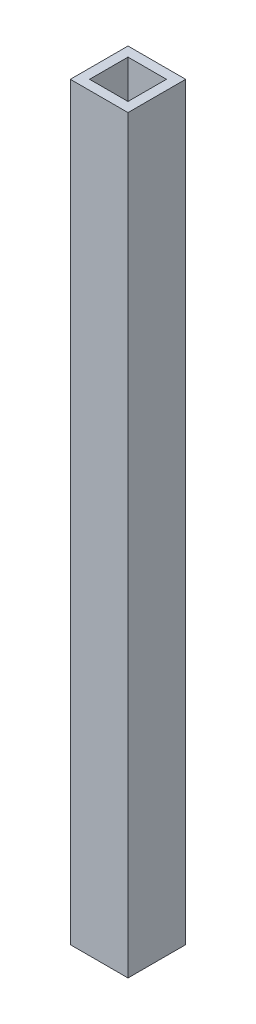
ISO-10303-21;
HEADER;
FILE_DESCRIPTION(('STEP AP214'),'2;1');
FILE_NAME('part.step','',(''),(''),'','','');
FILE_SCHEMA(('AUTOMOTIVE_DESIGN { 1 0 10303 214 1 1 1 1 }'));
ENDSEC;
DATA;
#1=APPLICATION_CONTEXT('core data for automotive mechanical design processes');
#2=APPLICATION_PROTOCOL_DEFINITION('international standard','automotive_design',2000,#1);
#3=PRODUCT_CONTEXT('',#1,'mechanical');
#4=PRODUCT('Part','Part','',(#3));
#5=PRODUCT_RELATED_PRODUCT_CATEGORY('part','',(#4));
#6=PRODUCT_DEFINITION_FORMATION('','',#4);
#7=PRODUCT_DEFINITION_CONTEXT('part definition',#1,'design');
#8=PRODUCT_DEFINITION('design','',#6,#7);
#9=PRODUCT_DEFINITION_SHAPE('','',#8);
#10=(LENGTH_UNIT() NAMED_UNIT(*) SI_UNIT(.MILLI.,.METRE.));
#11=(NAMED_UNIT(*) PLANE_ANGLE_UNIT() SI_UNIT($,.RADIAN.));
#12=(NAMED_UNIT(*) SI_UNIT($,.STERADIAN.) SOLID_ANGLE_UNIT());
#13=UNCERTAINTY_MEASURE_WITH_UNIT(LENGTH_MEASURE(1.E-05),#10,'distance_accuracy_value','');
#14=(GEOMETRIC_REPRESENTATION_CONTEXT(3) GLOBAL_UNCERTAINTY_ASSIGNED_CONTEXT((#13)) GLOBAL_UNIT_ASSIGNED_CONTEXT((#10,
#11,#12)) REPRESENTATION_CONTEXT('',''));
#15=CARTESIAN_POINT('',(0.,0.,0.));
#16=DIRECTION('',(0.,0.,1.));
#17=DIRECTION('',(1.,0.,0.));
#18=AXIS2_PLACEMENT_3D('',#15,#16,#17);
#19=CARTESIAN_POINT('',(0.,390.,0.));
#20=DIRECTION('',(0.,-1.,0.));
#21=DIRECTION('',(0.,0.,-1.));
#22=AXIS2_PLACEMENT_3D('',#19,#20,#21);
#23=PLANE('',#22);
#24=DIRECTION('',(0.,0.,1.));
#25=VECTOR('',#24,1.);
#26=CARTESIAN_POINT('',(0.,390.,0.));
#27=LINE('',#26,#25);
#28=CARTESIAN_POINT('',(0.,390.,-30.));
#29=VERTEX_POINT('',#28);
#30=CARTESIAN_POINT('',(0.,390.,0.));
#31=VERTEX_POINT('',#30);
#32=EDGE_CURVE('E134',#29,#31,#27,.T.);
#33=ORIENTED_EDGE('',*,*,#32,.T.);
#34=DIRECTION('',(1.,0.,0.));
#35=VECTOR('',#34,1.);
#36=CARTESIAN_POINT('',(0.,390.,0.));
#37=LINE('',#36,#35);
#38=CARTESIAN_POINT('',(30.,390.,0.));
#39=VERTEX_POINT('',#38);
#40=EDGE_CURVE('E137',#31,#39,#37,.T.);
#41=ORIENTED_EDGE('',*,*,#40,.T.);
#42=DIRECTION('',(0.,0.,-1.));
#43=VECTOR('',#42,1.);
#44=CARTESIAN_POINT('',(30.,390.,0.));
#45=LINE('',#44,#43);
#46=CARTESIAN_POINT('',(30.,390.,-30.));
#47=VERTEX_POINT('',#46);
#48=EDGE_CURVE('E140',#39,#47,#45,.T.);
#49=ORIENTED_EDGE('',*,*,#48,.T.);
#50=DIRECTION('',(-1.,0.,0.));
#51=VECTOR('',#50,1.);
#52=CARTESIAN_POINT('',(0.,390.,-30.));
#53=LINE('',#52,#51);
#54=EDGE_CURVE('E142',#47,#29,#53,.T.);
#55=ORIENTED_EDGE('',*,*,#54,.T.);
#56=EDGE_LOOP('',(#33,#41,#49,#55));
#57=FACE_BOUND('',#56,.T.);
#58=DIRECTION('',(0.,0.,1.));
#59=VECTOR('',#58,1.);
#60=CARTESIAN_POINT('',(5.,390.,-25.));
#61=LINE('',#60,#59);
#62=CARTESIAN_POINT('',(5.,390.,-25.));
#63=VERTEX_POINT('',#62);
#64=CARTESIAN_POINT('',(5.,390.,-5.));
#65=VERTEX_POINT('',#64);
#66=EDGE_CURVE('E98',#63,#65,#61,.T.);
#67=ORIENTED_EDGE('',*,*,#66,.F.);
#68=DIRECTION('',(-1.,0.,0.));
#69=VECTOR('',#68,1.);
#70=CARTESIAN_POINT('',(5.,390.,-25.));
#71=LINE('',#70,#69);
#72=CARTESIAN_POINT('',(25.,390.,-25.));
#73=VERTEX_POINT('',#72);
#74=EDGE_CURVE('E120',#73,#63,#71,.T.);
#75=ORIENTED_EDGE('',*,*,#74,.F.);
#76=DIRECTION('',(0.,0.,-1.));
#77=VECTOR('',#76,1.);
#78=CARTESIAN_POINT('',(25.,390.,-25.));
#79=LINE('',#78,#77);
#80=CARTESIAN_POINT('',(25.,390.,-5.));
#81=VERTEX_POINT('',#80);
#82=EDGE_CURVE('E118',#81,#73,#79,.T.);
#83=ORIENTED_EDGE('',*,*,#82,.F.);
#84=DIRECTION('',(1.,0.,0.));
#85=VECTOR('',#84,1.);
#86=CARTESIAN_POINT('',(5.,390.,-5.));
#87=LINE('',#86,#85);
#88=EDGE_CURVE('E106',#65,#81,#87,.T.);
#89=ORIENTED_EDGE('',*,*,#88,.F.);
#90=EDGE_LOOP('',(#67,#75,#83,#89));
#91=FACE_BOUND('',#90,.T.);
#92=ADVANCED_FACE('F33',(#57,#91),#23,.F.);
#93=CARTESIAN_POINT('',(0.,0.,0.));
#94=DIRECTION('',(0.,-1.,0.));
#95=DIRECTION('',(0.,0.,-1.));
#96=AXIS2_PLACEMENT_3D('',#93,#94,#95);
#97=PLANE('',#96);
#98=DIRECTION('',(0.,0.,1.));
#99=VECTOR('',#98,1.);
#100=CARTESIAN_POINT('',(0.,0.,0.));
#101=LINE('',#100,#99);
#102=CARTESIAN_POINT('',(0.,0.,-30.));
#103=VERTEX_POINT('',#102);
#104=CARTESIAN_POINT('',(0.,0.,0.));
#105=VERTEX_POINT('',#104);
#106=EDGE_CURVE('E114',#103,#105,#101,.T.);
#107=ORIENTED_EDGE('',*,*,#106,.F.);
#108=DIRECTION('',(-1.,0.,0.));
#109=VECTOR('',#108,1.);
#110=CARTESIAN_POINT('',(0.,0.,-30.));
#111=LINE('',#110,#109);
#112=CARTESIAN_POINT('',(30.,0.,-30.));
#113=VERTEX_POINT('',#112);
#114=EDGE_CURVE('E138',#113,#103,#111,.T.);
#115=ORIENTED_EDGE('',*,*,#114,.F.);
#116=DIRECTION('',(0.,0.,-1.));
#117=VECTOR('',#116,1.);
#118=CARTESIAN_POINT('',(30.,0.,0.));
#119=LINE('',#118,#117);
#120=CARTESIAN_POINT('',(30.,0.,0.));
#121=VERTEX_POINT('',#120);
#122=EDGE_CURVE('E149',#121,#113,#119,.T.);
#123=ORIENTED_EDGE('',*,*,#122,.F.);
#124=DIRECTION('',(1.,0.,0.));
#125=VECTOR('',#124,1.);
#126=CARTESIAN_POINT('',(0.,0.,0.));
#127=LINE('',#126,#125);
#128=EDGE_CURVE('E147',#105,#121,#127,.T.);
#129=ORIENTED_EDGE('',*,*,#128,.F.);
#130=EDGE_LOOP('',(#107,#115,#123,#129));
#131=FACE_BOUND('',#130,.T.);
#132=DIRECTION('',(-1.,0.,0.));
#133=VECTOR('',#132,1.);
#134=CARTESIAN_POINT('',(5.,0.,-25.));
#135=LINE('',#134,#133);
#136=CARTESIAN_POINT('',(25.,0.,-25.));
#137=VERTEX_POINT('',#136);
#138=CARTESIAN_POINT('',(5.,0.,-25.));
#139=VERTEX_POINT('',#138);
#140=EDGE_CURVE('E107',#137,#139,#135,.T.);
#141=ORIENTED_EDGE('',*,*,#140,.T.);
#142=DIRECTION('',(0.,0.,1.));
#143=VECTOR('',#142,1.);
#144=CARTESIAN_POINT('',(5.,0.,-25.));
#145=LINE('',#144,#143);
#146=CARTESIAN_POINT('',(5.,0.,-5.));
#147=VERTEX_POINT('',#146);
#148=EDGE_CURVE('E56',#139,#147,#145,.T.);
#149=ORIENTED_EDGE('',*,*,#148,.T.);
#150=DIRECTION('',(1.,0.,0.));
#151=VECTOR('',#150,1.);
#152=CARTESIAN_POINT('',(5.,0.,-5.));
#153=LINE('',#152,#151);
#154=CARTESIAN_POINT('',(25.,0.,-5.));
#155=VERTEX_POINT('',#154);
#156=EDGE_CURVE('E113',#147,#155,#153,.T.);
#157=ORIENTED_EDGE('',*,*,#156,.T.);
#158=DIRECTION('',(0.,0.,-1.));
#159=VECTOR('',#158,1.);
#160=CARTESIAN_POINT('',(25.,0.,-25.));
#161=LINE('',#160,#159);
#162=EDGE_CURVE('E126',#155,#137,#161,.T.);
#163=ORIENTED_EDGE('',*,*,#162,.T.);
#164=EDGE_LOOP('',(#141,#149,#157,#163));
#165=FACE_BOUND('',#164,.T.);
#166=ADVANCED_FACE('F167',(#131,#165),#97,.T.);
#167=CARTESIAN_POINT('',(0.,390.,0.));
#168=DIRECTION('',(1.,0.,0.));
#169=DIRECTION('',(0.,0.,-1.));
#170=AXIS2_PLACEMENT_3D('',#167,#168,#169);
#171=PLANE('',#170);
#172=ORIENTED_EDGE('',*,*,#106,.T.);
#173=DIRECTION('',(0.,-1.,0.));
#174=VECTOR('',#173,1.);
#175=CARTESIAN_POINT('',(0.,390.,0.));
#176=LINE('',#175,#174);
#177=EDGE_CURVE('E11',#31,#105,#176,.T.);
#178=ORIENTED_EDGE('',*,*,#177,.F.);
#179=ORIENTED_EDGE('',*,*,#32,.F.);
#180=DIRECTION('',(0.,-1.,0.));
#181=VECTOR('',#180,1.);
#182=CARTESIAN_POINT('',(0.,390.,-30.));
#183=LINE('',#182,#181);
#184=EDGE_CURVE('E144',#29,#103,#183,.T.);
#185=ORIENTED_EDGE('',*,*,#184,.T.);
#186=EDGE_LOOP('',(#172,#178,#179,#185));
#187=FACE_BOUND('',#186,.T.);
#188=ADVANCED_FACE('F35',(#187),#171,.F.);
#189=CARTESIAN_POINT('',(0.,390.,0.));
#190=DIRECTION('',(0.,0.,-1.));
#191=DIRECTION('',(-1.,0.,0.));
#192=AXIS2_PLACEMENT_3D('',#189,#190,#191);
#193=PLANE('',#192);
#194=ORIENTED_EDGE('',*,*,#128,.T.);
#195=DIRECTION('',(0.,-1.,0.));
#196=VECTOR('',#195,1.);
#197=CARTESIAN_POINT('',(30.,390.,0.));
#198=LINE('',#197,#196);
#199=EDGE_CURVE('E41',#39,#121,#198,.T.);
#200=ORIENTED_EDGE('',*,*,#199,.F.);
#201=ORIENTED_EDGE('',*,*,#40,.F.);
#202=ORIENTED_EDGE('',*,*,#177,.T.);
#203=EDGE_LOOP('',(#194,#200,#201,#202));
#204=FACE_BOUND('',#203,.T.);
#205=ADVANCED_FACE('F177',(#204),#193,.F.);
#206=CARTESIAN_POINT('',(30.,390.,0.));
#207=DIRECTION('',(-1.,0.,0.));
#208=DIRECTION('',(0.,0.,1.));
#209=AXIS2_PLACEMENT_3D('',#206,#207,#208);
#210=PLANE('',#209);
#211=ORIENTED_EDGE('',*,*,#122,.T.);
#212=DIRECTION('',(0.,-1.,0.));
#213=VECTOR('',#212,1.);
#214=CARTESIAN_POINT('',(30.,390.,-30.));
#215=LINE('',#214,#213);
#216=EDGE_CURVE('E154',#47,#113,#215,.T.);
#217=ORIENTED_EDGE('',*,*,#216,.F.);
#218=ORIENTED_EDGE('',*,*,#48,.F.);
#219=ORIENTED_EDGE('',*,*,#199,.T.);
#220=EDGE_LOOP('',(#211,#217,#218,#219));
#221=FACE_BOUND('',#220,.T.);
#222=ADVANCED_FACE('F161',(#221),#210,.F.);
#223=CARTESIAN_POINT('',(0.,390.,-30.));
#224=DIRECTION('',(0.,0.,1.));
#225=DIRECTION('',(1.,0.,0.));
#226=AXIS2_PLACEMENT_3D('',#223,#224,#225);
#227=PLANE('',#226);
#228=ORIENTED_EDGE('',*,*,#114,.T.);
#229=ORIENTED_EDGE('',*,*,#184,.F.);
#230=ORIENTED_EDGE('',*,*,#54,.F.);
#231=ORIENTED_EDGE('',*,*,#216,.T.);
#232=EDGE_LOOP('',(#228,#229,#230,#231));
#233=FACE_BOUND('',#232,.T.);
#234=ADVANCED_FACE('F171',(#233),#227,.F.);
#235=CARTESIAN_POINT('',(5.,390.,-25.));
#236=DIRECTION('',(1.,0.,0.));
#237=DIRECTION('',(0.,0.,-1.));
#238=AXIS2_PLACEMENT_3D('',#235,#236,#237);
#239=PLANE('',#238);
#240=ORIENTED_EDGE('',*,*,#148,.F.);
#241=DIRECTION('',(0.,-1.,0.));
#242=VECTOR('',#241,1.);
#243=CARTESIAN_POINT('',(5.,390.,-25.));
#244=LINE('',#243,#242);
#245=EDGE_CURVE('E102',#63,#139,#244,.T.);
#246=ORIENTED_EDGE('',*,*,#245,.F.);
#247=ORIENTED_EDGE('',*,*,#66,.T.);
#248=DIRECTION('',(0.,-1.,0.));
#249=VECTOR('',#248,1.);
#250=CARTESIAN_POINT('',(5.,390.,-5.));
#251=LINE('',#250,#249);
#252=EDGE_CURVE('E101',#65,#147,#251,.T.);
#253=ORIENTED_EDGE('',*,*,#252,.T.);
#254=EDGE_LOOP('',(#240,#246,#247,#253));
#255=FACE_BOUND('',#254,.T.);
#256=ADVANCED_FACE('F100',(#255),#239,.T.);
#257=CARTESIAN_POINT('',(5.,390.,-5.));
#258=DIRECTION('',(0.,0.,-1.));
#259=DIRECTION('',(-1.,0.,0.));
#260=AXIS2_PLACEMENT_3D('',#257,#258,#259);
#261=PLANE('',#260);
#262=ORIENTED_EDGE('',*,*,#156,.F.);
#263=ORIENTED_EDGE('',*,*,#252,.F.);
#264=ORIENTED_EDGE('',*,*,#88,.T.);
#265=DIRECTION('',(0.,-1.,0.));
#266=VECTOR('',#265,1.);
#267=CARTESIAN_POINT('',(25.,390.,-5.));
#268=LINE('',#267,#266);
#269=EDGE_CURVE('E115',#81,#155,#268,.T.);
#270=ORIENTED_EDGE('',*,*,#269,.T.);
#271=EDGE_LOOP('',(#262,#263,#264,#270));
#272=FACE_BOUND('',#271,.T.);
#273=ADVANCED_FACE('F110',(#272),#261,.T.);
#274=CARTESIAN_POINT('',(25.,390.,-25.));
#275=DIRECTION('',(-1.,0.,0.));
#276=DIRECTION('',(0.,0.,1.));
#277=AXIS2_PLACEMENT_3D('',#274,#275,#276);
#278=PLANE('',#277);
#279=ORIENTED_EDGE('',*,*,#162,.F.);
#280=ORIENTED_EDGE('',*,*,#269,.F.);
#281=ORIENTED_EDGE('',*,*,#82,.T.);
#282=DIRECTION('',(0.,-1.,0.));
#283=VECTOR('',#282,1.);
#284=CARTESIAN_POINT('',(25.,390.,-25.));
#285=LINE('',#284,#283);
#286=EDGE_CURVE('E48',#73,#137,#285,.T.);
#287=ORIENTED_EDGE('',*,*,#286,.T.);
#288=EDGE_LOOP('',(#279,#280,#281,#287));
#289=FACE_BOUND('',#288,.T.);
#290=ADVANCED_FACE('F200',(#289),#278,.T.);
#291=CARTESIAN_POINT('',(5.,390.,-25.));
#292=DIRECTION('',(0.,0.,1.));
#293=DIRECTION('',(1.,0.,0.));
#294=AXIS2_PLACEMENT_3D('',#291,#292,#293);
#295=PLANE('',#294);
#296=ORIENTED_EDGE('',*,*,#140,.F.);
#297=ORIENTED_EDGE('',*,*,#286,.F.);
#298=ORIENTED_EDGE('',*,*,#74,.T.);
#299=ORIENTED_EDGE('',*,*,#245,.T.);
#300=EDGE_LOOP('',(#296,#297,#298,#299));
#301=FACE_BOUND('',#300,.T.);
#302=ADVANCED_FACE('F204',(#301),#295,.T.);
#303=CLOSED_SHELL('',(#92,#166,#188,#205,#222,#234,#256,#273,#290,#302));
#304=MANIFOLD_SOLID_BREP('B2',#303);
#305=ADVANCED_BREP_SHAPE_REPRESENTATION('',(#18,#304),#14);
#306=SHAPE_DEFINITION_REPRESENTATION(#9,#305);
ENDSEC;
END-ISO-10303-21;
